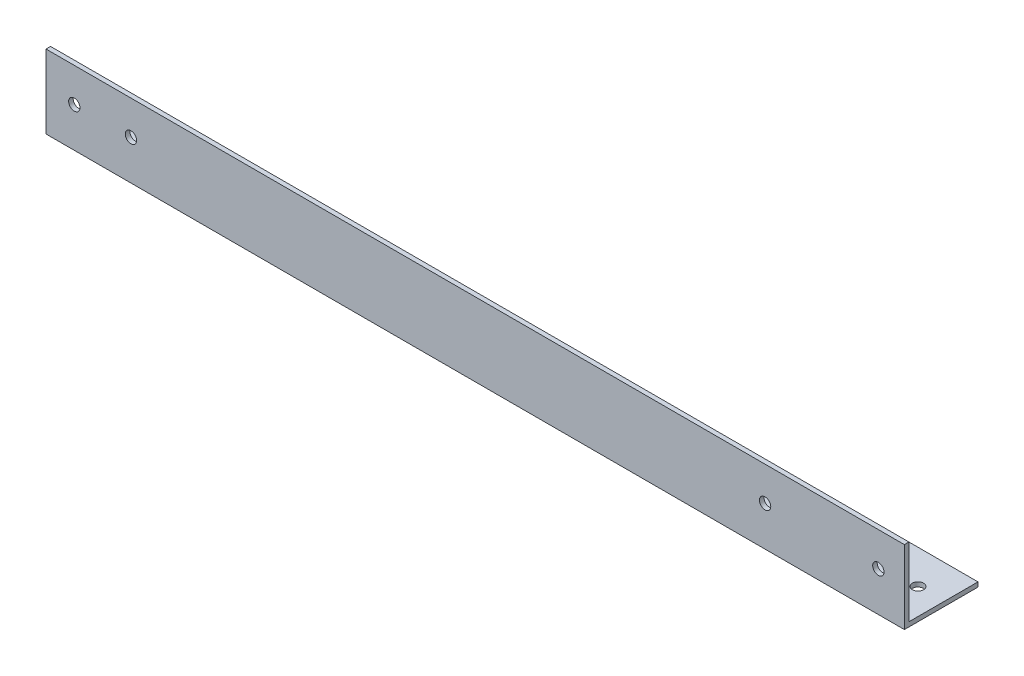
ISO-10303-21;
HEADER;
FILE_DESCRIPTION(('STEP AP214'),'2;1');
FILE_NAME('part.step','',(''),(''),'','','');
FILE_SCHEMA(('AUTOMOTIVE_DESIGN { 1 0 10303 214 1 1 1 1 }'));
ENDSEC;
DATA;
#1=APPLICATION_CONTEXT('core data for automotive mechanical design processes');
#2=APPLICATION_PROTOCOL_DEFINITION('international standard','automotive_design',2000,#1);
#3=PRODUCT_CONTEXT('',#1,'mechanical');
#4=PRODUCT('Part','Part','',(#3));
#5=PRODUCT_RELATED_PRODUCT_CATEGORY('part','',(#4));
#6=PRODUCT_DEFINITION_FORMATION('','',#4);
#7=PRODUCT_DEFINITION_CONTEXT('part definition',#1,'design');
#8=PRODUCT_DEFINITION('design','',#6,#7);
#9=PRODUCT_DEFINITION_SHAPE('','',#8);
#10=(LENGTH_UNIT() NAMED_UNIT(*) SI_UNIT(.MILLI.,.METRE.));
#11=(NAMED_UNIT(*) PLANE_ANGLE_UNIT() SI_UNIT($,.RADIAN.));
#12=(NAMED_UNIT(*) SI_UNIT($,.STERADIAN.) SOLID_ANGLE_UNIT());
#13=UNCERTAINTY_MEASURE_WITH_UNIT(LENGTH_MEASURE(1.E-05),#10,'distance_accuracy_value','');
#14=(GEOMETRIC_REPRESENTATION_CONTEXT(3) GLOBAL_UNCERTAINTY_ASSIGNED_CONTEXT((#13)) GLOBAL_UNIT_ASSIGNED_CONTEXT((#10,
#11,#12)) REPRESENTATION_CONTEXT('',''));
#15=CARTESIAN_POINT('',(0.,0.,0.));
#16=DIRECTION('',(0.,0.,1.));
#17=DIRECTION('',(1.,0.,0.));
#18=AXIS2_PLACEMENT_3D('',#15,#16,#17);
#19=CARTESIAN_POINT('',(758.,0.,0.));
#20=DIRECTION('',(0.,1.,0.));
#21=DIRECTION('',(0.,0.,1.));
#22=AXIS2_PLACEMENT_3D('',#19,#20,#21);
#23=PLANE('',#22);
#24=CARTESIAN_POINT('',(75.,0.,-35.));
#25=DIRECTION('',(0.,-1.,0.));
#26=DIRECTION('',(0.,0.,-1.));
#27=AXIS2_PLACEMENT_3D('',#24,#25,#26);
#28=CIRCLE('',#27,4.99999999999999);
#29=CARTESIAN_POINT('',(75.,0.,-40.));
#30=VERTEX_POINT('',#29);
#31=EDGE_CURVE('E134',#30,#30,#28,.T.);
#32=ORIENTED_EDGE('',*,*,#31,.F.);
#33=EDGE_LOOP('',(#32));
#34=FACE_BOUND('',#33,.T.);
#35=CARTESIAN_POINT('',(735.,0.,-35.));
#36=DIRECTION('',(0.,-1.,0.));
#37=DIRECTION('',(0.,0.,1.));
#38=AXIS2_PLACEMENT_3D('',#35,#36,#37);
#39=CIRCLE('',#38,5.00000000000005);
#40=CARTESIAN_POINT('',(735.,0.,-30.));
#41=VERTEX_POINT('',#40);
#42=EDGE_CURVE('E251',#41,#41,#39,.T.);
#43=ORIENTED_EDGE('',*,*,#42,.F.);
#44=EDGE_LOOP('',(#43));
#45=FACE_BOUND('',#44,.T.);
#46=CARTESIAN_POINT('',(635.,0.,-35.));
#47=DIRECTION('',(0.,-1.,0.));
#48=DIRECTION('',(0.,0.,1.));
#49=AXIS2_PLACEMENT_3D('',#46,#47,#48);
#50=CIRCLE('',#49,5.00000000000005);
#51=CARTESIAN_POINT('',(635.,0.,-30.));
#52=VERTEX_POINT('',#51);
#53=EDGE_CURVE('E147',#52,#52,#50,.T.);
#54=ORIENTED_EDGE('',*,*,#53,.F.);
#55=EDGE_LOOP('',(#54));
#56=FACE_BOUND('',#55,.T.);
#57=CARTESIAN_POINT('',(25.,0.,-35.));
#58=DIRECTION('',(0.,-1.,0.));
#59=DIRECTION('',(0.,0.,-1.));
#60=AXIS2_PLACEMENT_3D('',#57,#58,#59);
#61=CIRCLE('',#60,5.);
#62=CARTESIAN_POINT('',(25.,0.,-40.));
#63=VERTEX_POINT('',#62);
#64=EDGE_CURVE('E130',#63,#63,#61,.T.);
#65=ORIENTED_EDGE('',*,*,#64,.F.);
#66=EDGE_LOOP('',(#65));
#67=FACE_BOUND('',#66,.T.);
#68=DIRECTION('',(0.,0.,-1.));
#69=VECTOR('',#68,1.);
#70=CARTESIAN_POINT('',(0.,0.,0.));
#71=LINE('',#70,#69);
#72=CARTESIAN_POINT('',(0.,0.,0.));
#73=VERTEX_POINT('',#72);
#74=CARTESIAN_POINT('',(0.,0.,-65.));
#75=VERTEX_POINT('',#74);
#76=EDGE_CURVE('E172',#73,#75,#71,.T.);
#77=ORIENTED_EDGE('',*,*,#76,.T.);
#78=DIRECTION('',(-1.,0.,0.));
#79=VECTOR('',#78,1.);
#80=CARTESIAN_POINT('',(758.,0.,-65.));
#81=LINE('',#80,#79);
#82=CARTESIAN_POINT('',(758.,0.,-65.));
#83=VERTEX_POINT('',#82);
#84=EDGE_CURVE('E11',#83,#75,#81,.T.);
#85=ORIENTED_EDGE('',*,*,#84,.F.);
#86=DIRECTION('',(0.,0.,-1.));
#87=VECTOR('',#86,1.);
#88=CARTESIAN_POINT('',(758.,0.,0.));
#89=LINE('',#88,#87);
#90=CARTESIAN_POINT('',(758.,0.,0.));
#91=VERTEX_POINT('',#90);
#92=EDGE_CURVE('E173',#91,#83,#89,.T.);
#93=ORIENTED_EDGE('',*,*,#92,.F.);
#94=DIRECTION('',(-1.,0.,0.));
#95=VECTOR('',#94,1.);
#96=CARTESIAN_POINT('',(758.,0.,0.));
#97=LINE('',#96,#95);
#98=EDGE_CURVE('E120',#91,#73,#97,.T.);
#99=ORIENTED_EDGE('',*,*,#98,.T.);
#100=EDGE_LOOP('',(#77,#85,#93,#99));
#101=FACE_BOUND('',#100,.T.);
#102=ADVANCED_FACE('F37',(#34,#45,#56,#67,#101),#23,.F.);
#103=CARTESIAN_POINT('',(758.,4.,-65.));
#104=DIRECTION('',(0.,0.,-1.));
#105=DIRECTION('',(-1.,0.,0.));
#106=AXIS2_PLACEMENT_3D('',#103,#104,#105);
#107=PLANE('',#106);
#108=DIRECTION('',(0.,-1.,0.));
#109=VECTOR('',#108,1.);
#110=CARTESIAN_POINT('',(0.,4.,-65.));
#111=LINE('',#110,#109);
#112=CARTESIAN_POINT('',(0.,4.,-65.));
#113=VERTEX_POINT('',#112);
#114=EDGE_CURVE('E180',#113,#75,#111,.T.);
#115=ORIENTED_EDGE('',*,*,#114,.F.);
#116=DIRECTION('',(-1.,0.,0.));
#117=VECTOR('',#116,1.);
#118=CARTESIAN_POINT('',(758.,4.,-65.));
#119=LINE('',#118,#117);
#120=CARTESIAN_POINT('',(758.,4.,-65.));
#121=VERTEX_POINT('',#120);
#122=EDGE_CURVE('E46',#121,#113,#119,.T.);
#123=ORIENTED_EDGE('',*,*,#122,.F.);
#124=DIRECTION('',(0.,-1.,0.));
#125=VECTOR('',#124,1.);
#126=CARTESIAN_POINT('',(758.,4.,-65.));
#127=LINE('',#126,#125);
#128=EDGE_CURVE('E88',#121,#83,#127,.T.);
#129=ORIENTED_EDGE('',*,*,#128,.T.);
#130=ORIENTED_EDGE('',*,*,#84,.T.);
#131=EDGE_LOOP('',(#115,#123,#129,#130));
#132=FACE_BOUND('',#131,.T.);
#133=ADVANCED_FACE('F193',(#132),#107,.T.);
#134=CARTESIAN_POINT('',(758.,4.,0.));
#135=DIRECTION('',(0.,1.,0.));
#136=DIRECTION('',(0.,0.,1.));
#137=AXIS2_PLACEMENT_3D('',#134,#135,#136);
#138=PLANE('',#137);
#139=CARTESIAN_POINT('',(75.,4.,-35.));
#140=DIRECTION('',(0.,1.,0.));
#141=DIRECTION('',(0.,0.,1.));
#142=AXIS2_PLACEMENT_3D('',#139,#140,#141);
#143=CIRCLE('',#142,4.99999999999999);
#144=CARTESIAN_POINT('',(75.,4.,-30.));
#145=VERTEX_POINT('',#144);
#146=EDGE_CURVE('E40',#145,#145,#143,.T.);
#147=ORIENTED_EDGE('',*,*,#146,.F.);
#148=EDGE_LOOP('',(#147));
#149=FACE_BOUND('',#148,.T.);
#150=CARTESIAN_POINT('',(735.,4.,-35.));
#151=DIRECTION('',(0.,1.,0.));
#152=DIRECTION('',(0.,0.,1.));
#153=AXIS2_PLACEMENT_3D('',#150,#151,#152);
#154=CIRCLE('',#153,5.00000000000005);
#155=CARTESIAN_POINT('',(735.,4.,-30.));
#156=VERTEX_POINT('',#155);
#157=EDGE_CURVE('E133',#156,#156,#154,.T.);
#158=ORIENTED_EDGE('',*,*,#157,.F.);
#159=EDGE_LOOP('',(#158));
#160=FACE_BOUND('',#159,.T.);
#161=CARTESIAN_POINT('',(635.,4.,-35.));
#162=DIRECTION('',(0.,1.,0.));
#163=DIRECTION('',(0.,0.,1.));
#164=AXIS2_PLACEMENT_3D('',#161,#162,#163);
#165=CIRCLE('',#164,5.00000000000005);
#166=CARTESIAN_POINT('',(635.,4.,-30.));
#167=VERTEX_POINT('',#166);
#168=EDGE_CURVE('E131',#167,#167,#165,.T.);
#169=ORIENTED_EDGE('',*,*,#168,.F.);
#170=EDGE_LOOP('',(#169));
#171=FACE_BOUND('',#170,.T.);
#172=CARTESIAN_POINT('',(25.,4.,-35.));
#173=DIRECTION('',(0.,1.,0.));
#174=DIRECTION('',(0.,0.,1.));
#175=AXIS2_PLACEMENT_3D('',#172,#173,#174);
#176=CIRCLE('',#175,5.);
#177=CARTESIAN_POINT('',(25.,4.,-30.));
#178=VERTEX_POINT('',#177);
#179=EDGE_CURVE('E126',#178,#178,#176,.T.);
#180=ORIENTED_EDGE('',*,*,#179,.F.);
#181=EDGE_LOOP('',(#180));
#182=FACE_BOUND('',#181,.T.);
#183=DIRECTION('',(0.,0.,-1.));
#184=VECTOR('',#183,1.);
#185=CARTESIAN_POINT('',(0.,4.,0.));
#186=LINE('',#185,#184);
#187=CARTESIAN_POINT('',(0.,4.,-4.));
#188=VERTEX_POINT('',#187);
#189=EDGE_CURVE('E182',#188,#113,#186,.T.);
#190=ORIENTED_EDGE('',*,*,#189,.F.);
#191=DIRECTION('',(-1.,0.,0.));
#192=VECTOR('',#191,1.);
#193=CARTESIAN_POINT('',(758.,4.,-4.));
#194=LINE('',#193,#192);
#195=CARTESIAN_POINT('',(758.,4.,-4.));
#196=VERTEX_POINT('',#195);
#197=EDGE_CURVE('E117',#196,#188,#194,.T.);
#198=ORIENTED_EDGE('',*,*,#197,.F.);
#199=DIRECTION('',(0.,0.,-1.));
#200=VECTOR('',#199,1.);
#201=CARTESIAN_POINT('',(758.,4.,0.));
#202=LINE('',#201,#200);
#203=EDGE_CURVE('E110',#196,#121,#202,.T.);
#204=ORIENTED_EDGE('',*,*,#203,.T.);
#205=ORIENTED_EDGE('',*,*,#122,.T.);
#206=EDGE_LOOP('',(#190,#198,#204,#205));
#207=FACE_BOUND('',#206,.T.);
#208=ADVANCED_FACE('F195',(#149,#160,#171,#182,#207),#138,.T.);
#209=CARTESIAN_POINT('',(758.,0.,-4.));
#210=DIRECTION('',(0.,0.,-1.));
#211=DIRECTION('',(-1.,0.,0.));
#212=AXIS2_PLACEMENT_3D('',#209,#210,#211);
#213=PLANE('',#212);
#214=CARTESIAN_POINT('',(75.,35.,-4.));
#215=DIRECTION('',(0.,0.,-1.));
#216=DIRECTION('',(-1.,0.,0.));
#217=AXIS2_PLACEMENT_3D('',#214,#215,#216);
#218=CIRCLE('',#217,5.00000000000001);
#219=CARTESIAN_POINT('',(70.,35.,-4.));
#220=VERTEX_POINT('',#219);
#221=EDGE_CURVE('E163',#220,#220,#218,.T.);
#222=ORIENTED_EDGE('',*,*,#221,.F.);
#223=EDGE_LOOP('',(#222));
#224=FACE_BOUND('',#223,.T.);
#225=CARTESIAN_POINT('',(735.,35.,-4.));
#226=DIRECTION('',(0.,0.,-1.));
#227=DIRECTION('',(-1.,0.,0.));
#228=AXIS2_PLACEMENT_3D('',#225,#226,#227);
#229=CIRCLE('',#228,5.00000000000005);
#230=CARTESIAN_POINT('',(730.,35.,-4.));
#231=VERTEX_POINT('',#230);
#232=EDGE_CURVE('E160',#231,#231,#229,.T.);
#233=ORIENTED_EDGE('',*,*,#232,.F.);
#234=EDGE_LOOP('',(#233));
#235=FACE_BOUND('',#234,.T.);
#236=CARTESIAN_POINT('',(635.,35.,-4.));
#237=DIRECTION('',(0.,0.,-1.));
#238=DIRECTION('',(-1.,0.,0.));
#239=AXIS2_PLACEMENT_3D('',#236,#237,#238);
#240=CIRCLE('',#239,5.00000000000005);
#241=CARTESIAN_POINT('',(630.,35.,-4.));
#242=VERTEX_POINT('',#241);
#243=EDGE_CURVE('E152',#242,#242,#240,.T.);
#244=ORIENTED_EDGE('',*,*,#243,.F.);
#245=EDGE_LOOP('',(#244));
#246=FACE_BOUND('',#245,.T.);
#247=CARTESIAN_POINT('',(25.,35.,-4.));
#248=DIRECTION('',(0.,0.,-1.));
#249=DIRECTION('',(-1.,0.,0.));
#250=AXIS2_PLACEMENT_3D('',#247,#248,#249);
#251=CIRCLE('',#250,5.);
#252=CARTESIAN_POINT('',(20.,35.,-4.));
#253=VERTEX_POINT('',#252);
#254=EDGE_CURVE('E169',#253,#253,#251,.T.);
#255=ORIENTED_EDGE('',*,*,#254,.F.);
#256=EDGE_LOOP('',(#255));
#257=FACE_BOUND('',#256,.T.);
#258=DIRECTION('',(0.,1.,0.));
#259=VECTOR('',#258,1.);
#260=CARTESIAN_POINT('',(0.,0.,-4.));
#261=LINE('',#260,#259);
#262=CARTESIAN_POINT('',(0.,65.,-4.));
#263=VERTEX_POINT('',#262);
#264=EDGE_CURVE('E116',#263,#188,#261,.F.);
#265=ORIENTED_EDGE('',*,*,#264,.F.);
#266=DIRECTION('',(-1.,0.,0.));
#267=VECTOR('',#266,1.);
#268=CARTESIAN_POINT('',(758.,65.,-4.));
#269=LINE('',#268,#267);
#270=CARTESIAN_POINT('',(758.,65.,-4.));
#271=VERTEX_POINT('',#270);
#272=EDGE_CURVE('E103',#271,#263,#269,.T.);
#273=ORIENTED_EDGE('',*,*,#272,.F.);
#274=DIRECTION('',(0.,1.,0.));
#275=VECTOR('',#274,1.);
#276=CARTESIAN_POINT('',(758.,0.,-4.));
#277=LINE('',#276,#275);
#278=EDGE_CURVE('E106',#271,#196,#277,.F.);
#279=ORIENTED_EDGE('',*,*,#278,.T.);
#280=ORIENTED_EDGE('',*,*,#197,.T.);
#281=EDGE_LOOP('',(#265,#273,#279,#280));
#282=FACE_BOUND('',#281,.T.);
#283=ADVANCED_FACE('F115',(#224,#235,#246,#257,#282),#213,.T.);
#284=CARTESIAN_POINT('',(758.,65.,0.));
#285=DIRECTION('',(0.,1.,0.));
#286=DIRECTION('',(0.,0.,1.));
#287=AXIS2_PLACEMENT_3D('',#284,#285,#286);
#288=PLANE('',#287);
#289=DIRECTION('',(0.,0.,-1.));
#290=VECTOR('',#289,1.);
#291=CARTESIAN_POINT('',(0.,65.,0.));
#292=LINE('',#291,#290);
#293=CARTESIAN_POINT('',(0.,65.,0.));
#294=VERTEX_POINT('',#293);
#295=EDGE_CURVE('E185',#294,#263,#292,.T.);
#296=ORIENTED_EDGE('',*,*,#295,.F.);
#297=DIRECTION('',(-1.,0.,0.));
#298=VECTOR('',#297,1.);
#299=CARTESIAN_POINT('',(758.,65.,0.));
#300=LINE('',#299,#298);
#301=CARTESIAN_POINT('',(758.,65.,0.));
#302=VERTEX_POINT('',#301);
#303=EDGE_CURVE('E105',#302,#294,#300,.T.);
#304=ORIENTED_EDGE('',*,*,#303,.F.);
#305=DIRECTION('',(0.,0.,-1.));
#306=VECTOR('',#305,1.);
#307=CARTESIAN_POINT('',(758.,65.,0.));
#308=LINE('',#307,#306);
#309=EDGE_CURVE('E98',#302,#271,#308,.T.);
#310=ORIENTED_EDGE('',*,*,#309,.T.);
#311=ORIENTED_EDGE('',*,*,#272,.T.);
#312=EDGE_LOOP('',(#296,#304,#310,#311));
#313=FACE_BOUND('',#312,.T.);
#314=ADVANCED_FACE('F101',(#313),#288,.T.);
#315=CARTESIAN_POINT('',(758.,0.,0.));
#316=DIRECTION('',(0.,0.,-1.));
#317=DIRECTION('',(-1.,0.,0.));
#318=AXIS2_PLACEMENT_3D('',#315,#316,#317);
#319=PLANE('',#318);
#320=CARTESIAN_POINT('',(75.,35.,0.));
#321=DIRECTION('',(0.,0.,1.));
#322=DIRECTION('',(1.,0.,0.));
#323=AXIS2_PLACEMENT_3D('',#320,#321,#322);
#324=CIRCLE('',#323,5.00000000000001);
#325=CARTESIAN_POINT('',(80.,35.,0.));
#326=VERTEX_POINT('',#325);
#327=EDGE_CURVE('E149',#326,#326,#324,.T.);
#328=ORIENTED_EDGE('',*,*,#327,.F.);
#329=EDGE_LOOP('',(#328));
#330=FACE_BOUND('',#329,.T.);
#331=CARTESIAN_POINT('',(735.,35.,0.));
#332=DIRECTION('',(0.,0.,1.));
#333=DIRECTION('',(-1.,0.,0.));
#334=AXIS2_PLACEMENT_3D('',#331,#332,#333);
#335=CIRCLE('',#334,5.00000000000005);
#336=CARTESIAN_POINT('',(730.,35.,0.));
#337=VERTEX_POINT('',#336);
#338=EDGE_CURVE('E153',#337,#337,#335,.T.);
#339=ORIENTED_EDGE('',*,*,#338,.F.);
#340=EDGE_LOOP('',(#339));
#341=FACE_BOUND('',#340,.T.);
#342=CARTESIAN_POINT('',(635.,35.,0.));
#343=DIRECTION('',(0.,0.,1.));
#344=DIRECTION('',(-1.,0.,0.));
#345=AXIS2_PLACEMENT_3D('',#342,#343,#344);
#346=CIRCLE('',#345,5.00000000000005);
#347=CARTESIAN_POINT('',(630.,35.,0.));
#348=VERTEX_POINT('',#347);
#349=EDGE_CURVE('E129',#348,#348,#346,.T.);
#350=ORIENTED_EDGE('',*,*,#349,.F.);
#351=EDGE_LOOP('',(#350));
#352=FACE_BOUND('',#351,.T.);
#353=CARTESIAN_POINT('',(25.,35.,0.));
#354=DIRECTION('',(0.,0.,1.));
#355=DIRECTION('',(1.,0.,0.));
#356=AXIS2_PLACEMENT_3D('',#353,#354,#355);
#357=CIRCLE('',#356,5.);
#358=CARTESIAN_POINT('',(30.,35.,0.));
#359=VERTEX_POINT('',#358);
#360=EDGE_CURVE('E166',#359,#359,#357,.T.);
#361=ORIENTED_EDGE('',*,*,#360,.F.);
#362=EDGE_LOOP('',(#361));
#363=FACE_BOUND('',#362,.T.);
#364=DIRECTION('',(0.,-1.,0.));
#365=VECTOR('',#364,1.);
#366=CARTESIAN_POINT('',(0.,0.,0.));
#367=LINE('',#366,#365);
#368=EDGE_CURVE('E77',#294,#73,#367,.T.);
#369=ORIENTED_EDGE('',*,*,#368,.T.);
#370=ORIENTED_EDGE('',*,*,#98,.F.);
#371=DIRECTION('',(0.,-1.,0.));
#372=VECTOR('',#371,1.);
#373=CARTESIAN_POINT('',(758.,0.,0.));
#374=LINE('',#373,#372);
#375=EDGE_CURVE('E55',#302,#91,#374,.T.);
#376=ORIENTED_EDGE('',*,*,#375,.F.);
#377=ORIENTED_EDGE('',*,*,#303,.T.);
#378=EDGE_LOOP('',(#369,#370,#376,#377));
#379=FACE_BOUND('',#378,.T.);
#380=ADVANCED_FACE('F209',(#330,#341,#352,#363,#379),#319,.F.);
#381=CARTESIAN_POINT('',(758.,0.,0.));
#382=DIRECTION('',(-1.,0.,0.));
#383=DIRECTION('',(0.,0.,1.));
#384=AXIS2_PLACEMENT_3D('',#381,#382,#383);
#385=PLANE('',#384);
#386=ORIENTED_EDGE('',*,*,#92,.T.);
#387=ORIENTED_EDGE('',*,*,#128,.F.);
#388=ORIENTED_EDGE('',*,*,#203,.F.);
#389=ORIENTED_EDGE('',*,*,#278,.F.);
#390=ORIENTED_EDGE('',*,*,#309,.F.);
#391=ORIENTED_EDGE('',*,*,#375,.T.);
#392=EDGE_LOOP('',(#386,#387,#388,#389,#390,#391));
#393=FACE_BOUND('',#392,.T.);
#394=ADVANCED_FACE('F109',(#393),#385,.F.);
#395=CARTESIAN_POINT('',(0.,0.,0.));
#396=DIRECTION('',(-1.,0.,0.));
#397=DIRECTION('',(0.,0.,1.));
#398=AXIS2_PLACEMENT_3D('',#395,#396,#397);
#399=PLANE('',#398);
#400=ORIENTED_EDGE('',*,*,#76,.F.);
#401=ORIENTED_EDGE('',*,*,#368,.F.);
#402=ORIENTED_EDGE('',*,*,#295,.T.);
#403=ORIENTED_EDGE('',*,*,#264,.T.);
#404=ORIENTED_EDGE('',*,*,#189,.T.);
#405=ORIENTED_EDGE('',*,*,#114,.T.);
#406=EDGE_LOOP('',(#400,#401,#402,#403,#404,#405));
#407=FACE_BOUND('',#406,.T.);
#408=ADVANCED_FACE('F190',(#407),#399,.T.);
#409=CARTESIAN_POINT('',(25.,35.,-10.));
#410=DIRECTION('',(0.,0.,1.));
#411=DIRECTION('',(1.,0.,0.));
#412=AXIS2_PLACEMENT_3D('',#409,#410,#411);
#413=CYLINDRICAL_SURFACE('',#412,5.);
#414=ORIENTED_EDGE('',*,*,#254,.T.);
#415=EDGE_LOOP('',(#414));
#416=FACE_BOUND('',#415,.T.);
#417=ORIENTED_EDGE('',*,*,#360,.T.);
#418=EDGE_LOOP('',(#417));
#419=FACE_BOUND('',#418,.T.);
#420=ADVANCED_FACE('F215',(#416,#419),#413,.F.);
#421=CARTESIAN_POINT('',(635.,35.,-10.));
#422=DIRECTION('',(0.,0.,1.));
#423=DIRECTION('',(1.,0.,0.));
#424=AXIS2_PLACEMENT_3D('',#421,#422,#423);
#425=CYLINDRICAL_SURFACE('',#424,5.00000000000005);
#426=ORIENTED_EDGE('',*,*,#243,.T.);
#427=EDGE_LOOP('',(#426));
#428=FACE_BOUND('',#427,.T.);
#429=ORIENTED_EDGE('',*,*,#349,.T.);
#430=EDGE_LOOP('',(#429));
#431=FACE_BOUND('',#430,.T.);
#432=ADVANCED_FACE('F220',(#428,#431),#425,.F.);
#433=CARTESIAN_POINT('',(735.,35.,-10.));
#434=DIRECTION('',(0.,0.,1.));
#435=DIRECTION('',(1.,0.,0.));
#436=AXIS2_PLACEMENT_3D('',#433,#434,#435);
#437=CYLINDRICAL_SURFACE('',#436,5.00000000000005);
#438=ORIENTED_EDGE('',*,*,#232,.T.);
#439=EDGE_LOOP('',(#438));
#440=FACE_BOUND('',#439,.T.);
#441=ORIENTED_EDGE('',*,*,#338,.T.);
#442=EDGE_LOOP('',(#441));
#443=FACE_BOUND('',#442,.T.);
#444=ADVANCED_FACE('F224',(#440,#443),#437,.F.);
#445=CARTESIAN_POINT('',(75.,35.,-10.));
#446=DIRECTION('',(0.,0.,1.));
#447=DIRECTION('',(1.,0.,0.));
#448=AXIS2_PLACEMENT_3D('',#445,#446,#447);
#449=CYLINDRICAL_SURFACE('',#448,5.00000000000001);
#450=ORIENTED_EDGE('',*,*,#221,.T.);
#451=EDGE_LOOP('',(#450));
#452=FACE_BOUND('',#451,.T.);
#453=ORIENTED_EDGE('',*,*,#327,.T.);
#454=EDGE_LOOP('',(#453));
#455=FACE_BOUND('',#454,.T.);
#456=ADVANCED_FACE('F228',(#452,#455),#449,.F.);
#457=CARTESIAN_POINT('',(25.,10.,-35.));
#458=DIRECTION('',(0.,-1.,0.));
#459=DIRECTION('',(0.,0.,-1.));
#460=AXIS2_PLACEMENT_3D('',#457,#458,#459);
#461=CYLINDRICAL_SURFACE('',#460,5.);
#462=ORIENTED_EDGE('',*,*,#179,.T.);
#463=EDGE_LOOP('',(#462));
#464=FACE_BOUND('',#463,.T.);
#465=ORIENTED_EDGE('',*,*,#64,.T.);
#466=EDGE_LOOP('',(#465));
#467=FACE_BOUND('',#466,.T.);
#468=ADVANCED_FACE('F232',(#464,#467),#461,.F.);
#469=CARTESIAN_POINT('',(635.,10.,-35.));
#470=DIRECTION('',(0.,-1.,0.));
#471=DIRECTION('',(0.,0.,-1.));
#472=AXIS2_PLACEMENT_3D('',#469,#470,#471);
#473=CYLINDRICAL_SURFACE('',#472,5.00000000000005);
#474=ORIENTED_EDGE('',*,*,#168,.T.);
#475=EDGE_LOOP('',(#474));
#476=FACE_BOUND('',#475,.T.);
#477=ORIENTED_EDGE('',*,*,#53,.T.);
#478=EDGE_LOOP('',(#477));
#479=FACE_BOUND('',#478,.T.);
#480=ADVANCED_FACE('F236',(#476,#479),#473,.F.);
#481=CARTESIAN_POINT('',(735.,10.,-35.));
#482=DIRECTION('',(0.,-1.,0.));
#483=DIRECTION('',(0.,0.,-1.));
#484=AXIS2_PLACEMENT_3D('',#481,#482,#483);
#485=CYLINDRICAL_SURFACE('',#484,5.00000000000005);
#486=ORIENTED_EDGE('',*,*,#157,.T.);
#487=EDGE_LOOP('',(#486));
#488=FACE_BOUND('',#487,.T.);
#489=ORIENTED_EDGE('',*,*,#42,.T.);
#490=EDGE_LOOP('',(#489));
#491=FACE_BOUND('',#490,.T.);
#492=ADVANCED_FACE('F240',(#488,#491),#485,.F.);
#493=CARTESIAN_POINT('',(75.,10.,-35.));
#494=DIRECTION('',(0.,-1.,0.));
#495=DIRECTION('',(0.,0.,-1.));
#496=AXIS2_PLACEMENT_3D('',#493,#494,#495);
#497=CYLINDRICAL_SURFACE('',#496,4.99999999999999);
#498=ORIENTED_EDGE('',*,*,#146,.T.);
#499=EDGE_LOOP('',(#498));
#500=FACE_BOUND('',#499,.T.);
#501=ORIENTED_EDGE('',*,*,#31,.T.);
#502=EDGE_LOOP('',(#501));
#503=FACE_BOUND('',#502,.T.);
#504=ADVANCED_FACE('F244',(#500,#503),#497,.F.);
#505=CLOSED_SHELL('',(#102,#133,#208,#283,#314,#380,#394,#408,#420,#432,#444,#456,#468,#480,
#492,#504));
#506=MANIFOLD_SOLID_BREP('B2',#505);
#507=ADVANCED_BREP_SHAPE_REPRESENTATION('',(#18,#506),#14);
#508=SHAPE_DEFINITION_REPRESENTATION(#9,#507);
ENDSEC;
END-ISO-10303-21;
